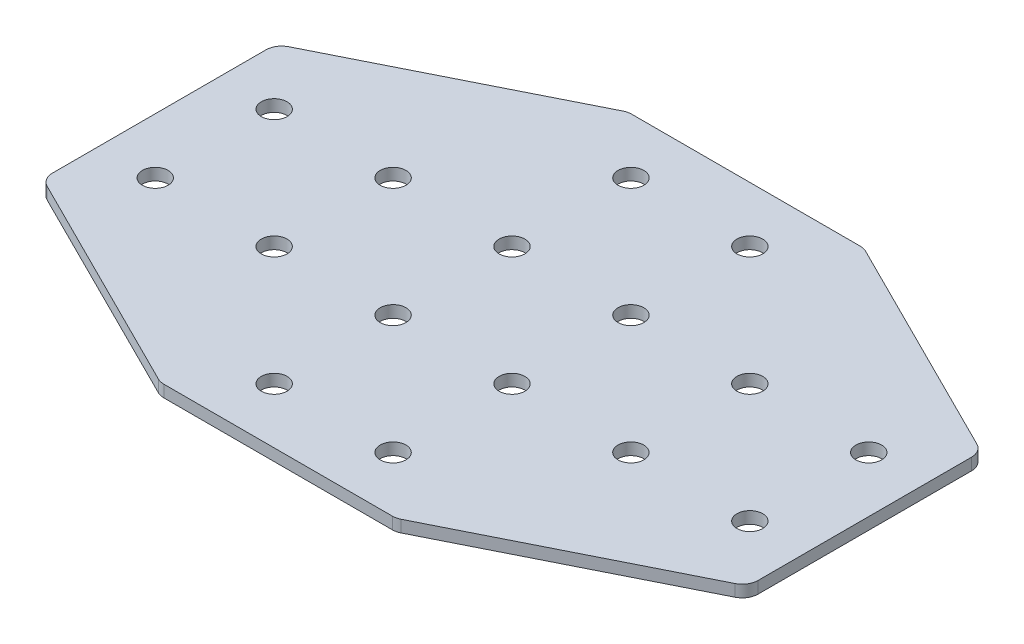
ISO-10303-21;
HEADER;
FILE_DESCRIPTION(('STEP AP214'),'2;1');
FILE_NAME('part.step','',(''),(''),'','','');
FILE_SCHEMA(('AUTOMOTIVE_DESIGN { 1 0 10303 214 1 1 1 1 }'));
ENDSEC;
DATA;
#1=APPLICATION_CONTEXT('core data for automotive mechanical design processes');
#2=APPLICATION_PROTOCOL_DEFINITION('international standard','automotive_design',2000,#1);
#3=PRODUCT_CONTEXT('',#1,'mechanical');
#4=PRODUCT('Part','Part','',(#3));
#5=PRODUCT_RELATED_PRODUCT_CATEGORY('part','',(#4));
#6=PRODUCT_DEFINITION_FORMATION('','',#4);
#7=PRODUCT_DEFINITION_CONTEXT('part definition',#1,'design');
#8=PRODUCT_DEFINITION('design','',#6,#7);
#9=PRODUCT_DEFINITION_SHAPE('','',#8);
#10=(LENGTH_UNIT() NAMED_UNIT(*) SI_UNIT(.MILLI.,.METRE.));
#11=(NAMED_UNIT(*) PLANE_ANGLE_UNIT() SI_UNIT($,.RADIAN.));
#12=(NAMED_UNIT(*) SI_UNIT($,.STERADIAN.) SOLID_ANGLE_UNIT());
#13=UNCERTAINTY_MEASURE_WITH_UNIT(LENGTH_MEASURE(1.E-05),#10,'distance_accuracy_value','');
#14=(GEOMETRIC_REPRESENTATION_CONTEXT(3) GLOBAL_UNCERTAINTY_ASSIGNED_CONTEXT((#13)) GLOBAL_UNIT_ASSIGNED_CONTEXT((#10,
#11,#12)) REPRESENTATION_CONTEXT('',''));
#15=CARTESIAN_POINT('',(0.,0.,0.));
#16=DIRECTION('',(0.,0.,1.));
#17=DIRECTION('',(1.,0.,0.));
#18=AXIS2_PLACEMENT_3D('',#15,#16,#17);
#19=CARTESIAN_POINT('',(-1.45351271942218,1.95798729377475,-1.25403448618044));
#20=DIRECTION('',(0.,-1.,0.));
#21=DIRECTION('',(0.,0.,-1.));
#22=AXIS2_PLACEMENT_3D('',#19,#20,#21);
#23=PLANE('',#22);
#24=CARTESIAN_POINT('',(-8.95351271942215,1.95798729377475,6.24596551381957));
#25=DIRECTION('',(0.,-1.,0.));
#26=DIRECTION('',(0.,0.,1.));
#27=AXIS2_PLACEMENT_3D('',#24,#25,#26);
#28=CIRCLE('',#27,1.625);
#29=CARTESIAN_POINT('',(-8.95351271942215,1.95798729377475,7.87096551381957));
#30=VERTEX_POINT('',#29);
#31=EDGE_CURVE('E140',#30,#30,#28,.T.);
#32=ORIENTED_EDGE('',*,*,#31,.F.);
#33=EDGE_LOOP('',(#32));
#34=FACE_BOUND('',#33,.T.);
#35=CARTESIAN_POINT('',(-8.95351271942218,1.95798729377475,21.2459655138196));
#36=DIRECTION('',(0.,-1.,0.));
#37=DIRECTION('',(0.,0.,1.));
#38=AXIS2_PLACEMENT_3D('',#35,#36,#37);
#39=CIRCLE('',#38,1.625);
#40=CARTESIAN_POINT('',(-8.95351271942218,1.95798729377475,22.8709655138196));
#41=VERTEX_POINT('',#40);
#42=EDGE_CURVE('E243',#41,#41,#39,.T.);
#43=ORIENTED_EDGE('',*,*,#42,.F.);
#44=EDGE_LOOP('',(#43));
#45=FACE_BOUND('',#44,.T.);
#46=CARTESIAN_POINT('',(-23.9535127194221,1.95798729377475,6.24596551381957));
#47=DIRECTION('',(0.,-1.,0.));
#48=DIRECTION('',(0.,0.,1.));
#49=AXIS2_PLACEMENT_3D('',#46,#47,#48);
#50=CIRCLE('',#49,1.625);
#51=CARTESIAN_POINT('',(-23.9535127194221,1.95798729377475,7.87096551381957));
#52=VERTEX_POINT('',#51);
#53=EDGE_CURVE('E237',#52,#52,#50,.T.);
#54=ORIENTED_EDGE('',*,*,#53,.F.);
#55=EDGE_LOOP('',(#54));
#56=FACE_BOUND('',#55,.T.);
#57=CARTESIAN_POINT('',(-38.9535127194222,1.95798729377475,6.24596551381956));
#58=DIRECTION('',(0.,-1.,0.));
#59=DIRECTION('',(0.,0.,1.));
#60=AXIS2_PLACEMENT_3D('',#57,#58,#59);
#61=CIRCLE('',#60,1.625);
#62=CARTESIAN_POINT('',(-38.9535127194222,1.95798729377475,7.87096551381956));
#63=VERTEX_POINT('',#62);
#64=EDGE_CURVE('E231',#63,#63,#61,.T.);
#65=ORIENTED_EDGE('',*,*,#64,.F.);
#66=EDGE_LOOP('',(#65));
#67=FACE_BOUND('',#66,.T.);
#68=CARTESIAN_POINT('',(6.04648728057779,1.95798729377475,6.24596551381956));
#69=DIRECTION('',(0.,1.,0.));
#70=DIRECTION('',(0.,0.,1.));
#71=AXIS2_PLACEMENT_3D('',#68,#69,#70);
#72=CIRCLE('',#71,1.625);
#73=CARTESIAN_POINT('',(6.04648728057779,1.95798729377475,7.87096551381957));
#74=VERTEX_POINT('',#73);
#75=EDGE_CURVE('E298',#74,#74,#72,.T.);
#76=ORIENTED_EDGE('',*,*,#75,.T.);
#77=EDGE_LOOP('',(#76));
#78=FACE_BOUND('',#77,.T.);
#79=CARTESIAN_POINT('',(6.04648728057782,1.95798729377475,21.2459655138196));
#80=DIRECTION('',(0.,1.,0.));
#81=DIRECTION('',(0.,0.,1.));
#82=AXIS2_PLACEMENT_3D('',#79,#80,#81);
#83=CIRCLE('',#82,1.625);
#84=CARTESIAN_POINT('',(6.04648728057782,1.95798729377475,22.8709655138196));
#85=VERTEX_POINT('',#84);
#86=EDGE_CURVE('E292',#85,#85,#83,.T.);
#87=ORIENTED_EDGE('',*,*,#86,.T.);
#88=EDGE_LOOP('',(#87));
#89=FACE_BOUND('',#88,.T.);
#90=CARTESIAN_POINT('',(21.0464872805778,1.95798729377475,6.24596551381957));
#91=DIRECTION('',(0.,1.,0.));
#92=DIRECTION('',(0.,0.,1.));
#93=AXIS2_PLACEMENT_3D('',#90,#91,#92);
#94=CIRCLE('',#93,1.625);
#95=CARTESIAN_POINT('',(21.0464872805778,1.95798729377475,7.87096551381957));
#96=VERTEX_POINT('',#95);
#97=EDGE_CURVE('E286',#96,#96,#94,.T.);
#98=ORIENTED_EDGE('',*,*,#97,.T.);
#99=EDGE_LOOP('',(#98));
#100=FACE_BOUND('',#99,.T.);
#101=CARTESIAN_POINT('',(36.0464872805778,1.95798729377475,6.24596551381955));
#102=DIRECTION('',(0.,1.,0.));
#103=DIRECTION('',(0.,0.,1.));
#104=AXIS2_PLACEMENT_3D('',#101,#102,#103);
#105=CIRCLE('',#104,1.625);
#106=CARTESIAN_POINT('',(36.0464872805778,1.95798729377475,7.87096551381955));
#107=VERTEX_POINT('',#106);
#108=EDGE_CURVE('E280',#107,#107,#105,.T.);
#109=ORIENTED_EDGE('',*,*,#108,.T.);
#110=EDGE_LOOP('',(#109));
#111=FACE_BOUND('',#110,.T.);
#112=DIRECTION('',(0.,0.,-1.));
#113=VECTOR('',#112,1.);
#114=CARTESIAN_POINT('',(-45.9535127194221,1.95798729377475,13.4369485194447));
#115=LINE('',#114,#113);
#116=CARTESIAN_POINT('',(-45.9535127194221,1.95798729377475,12.2008805419449));
#117=VERTEX_POINT('',#116);
#118=CARTESIAN_POINT('',(-45.9535127194221,1.95798729377475,-14.7089495143058));
#119=VERTEX_POINT('',#118);
#120=EDGE_CURVE('E253',#117,#119,#115,.T.);
#121=ORIENTED_EDGE('',*,*,#120,.T.);
#122=CARTESIAN_POINT('',(-43.9535127194221,1.95798729377475,-14.7089495143058));
#123=DIRECTION('',(0.,-1.,0.));
#124=DIRECTION('',(0.,0.,1.));
#125=AXIS2_PLACEMENT_3D('',#122,#123,#124);
#126=CIRCLE('',#125,2.);
#127=CARTESIAN_POINT('',(-44.847939910422,1.95798729377475,-16.4978038963056));
#128=VERTEX_POINT('',#127);
#129=EDGE_CURVE('E148',#119,#128,#126,.T.);
#130=ORIENTED_EDGE('',*,*,#129,.T.);
#131=DIRECTION('',(-0.894427190999916,0.,0.447213595499958));
#132=VECTOR('',#131,1.);
#133=CARTESIAN_POINT('',(-16.3354787306724,1.95798729377475,-30.7540344861804));
#134=LINE('',#133,#132);
#135=CARTESIAN_POINT('',(-16.7577699666727,1.95798729377475,-30.5428888681802));
#136=VERTEX_POINT('',#135);
#137=EDGE_CURVE('E158',#136,#128,#134,.T.);
#138=ORIENTED_EDGE('',*,*,#137,.F.);
#139=CARTESIAN_POINT('',(-15.8633427756728,1.95798729377475,-28.7540344861804));
#140=DIRECTION('',(0.,-1.,0.));
#141=DIRECTION('',(0.,0.,1.));
#142=AXIS2_PLACEMENT_3D('',#139,#140,#141);
#143=CIRCLE('',#142,2.);
#144=CARTESIAN_POINT('',(-15.8633427756728,1.95798729377475,-30.7540344861804));
#145=VERTEX_POINT('',#144);
#146=EDGE_CURVE('E168',#136,#145,#143,.T.);
#147=ORIENTED_EDGE('',*,*,#146,.T.);
#148=DIRECTION('',(1.,0.,0.));
#149=VECTOR('',#148,1.);
#150=CARTESIAN_POINT('',(-15.9535127194223,1.95798729377475,-30.7540344861804));
#151=LINE('',#150,#149);
#152=CARTESIAN_POINT('',(12.9563173368285,1.95798729377475,-30.7540344861804));
#153=VERTEX_POINT('',#152);
#154=EDGE_CURVE('E198',#145,#153,#151,.T.);
#155=ORIENTED_EDGE('',*,*,#154,.T.);
#156=CARTESIAN_POINT('',(12.9563173368285,1.95798729377475,-28.7540344861804));
#157=DIRECTION('',(0.,1.,0.));
#158=DIRECTION('',(0.,0.,1.));
#159=AXIS2_PLACEMENT_3D('',#156,#157,#158);
#160=CIRCLE('',#159,2.);
#161=CARTESIAN_POINT('',(13.8507445278284,1.95798729377475,-30.5428888681802));
#162=VERTEX_POINT('',#161);
#163=EDGE_CURVE('E220',#162,#153,#160,.T.);
#164=ORIENTED_EDGE('',*,*,#163,.F.);
#165=DIRECTION('',(0.894427190999916,0.,0.447213595499959));
#166=VECTOR('',#165,1.);
#167=CARTESIAN_POINT('',(13.428453291828,1.95798729377475,-30.7540344861804));
#168=LINE('',#167,#166);
#169=CARTESIAN_POINT('',(41.9409144715776,1.95798729377475,-16.4978038963056));
#170=VERTEX_POINT('',#169);
#171=EDGE_CURVE('E201',#162,#170,#168,.T.);
#172=ORIENTED_EDGE('',*,*,#171,.T.);
#173=CARTESIAN_POINT('',(41.0464872805777,1.95798729377475,-14.7089495143057));
#174=DIRECTION('',(0.,1.,0.));
#175=DIRECTION('',(0.,0.,1.));
#176=AXIS2_PLACEMENT_3D('',#173,#174,#175);
#177=CIRCLE('',#176,2.);
#178=CARTESIAN_POINT('',(43.0464872805777,1.95798729377475,-14.7089495143057));
#179=VERTEX_POINT('',#178);
#180=EDGE_CURVE('E217',#179,#170,#177,.T.);
#181=ORIENTED_EDGE('',*,*,#180,.F.);
#182=DIRECTION('',(0.,0.,-1.));
#183=VECTOR('',#182,1.);
#184=CARTESIAN_POINT('',(43.0464872805777,1.95798729377475,13.4369485194446));
#185=LINE('',#184,#183);
#186=CARTESIAN_POINT('',(43.0464872805777,1.95798729377475,12.2008805419449));
#187=VERTEX_POINT('',#186);
#188=EDGE_CURVE('E304',#187,#179,#185,.T.);
#189=ORIENTED_EDGE('',*,*,#188,.F.);
#190=CARTESIAN_POINT('',(41.0464872805777,1.95798729377475,12.2008805419449));
#191=DIRECTION('',(0.,-1.,0.));
#192=DIRECTION('',(0.,0.,-1.));
#193=AXIS2_PLACEMENT_3D('',#190,#191,#192);
#194=CIRCLE('',#193,2.);
#195=CARTESIAN_POINT('',(41.9409144715776,1.95798729377475,13.9897349239447));
#196=VERTEX_POINT('',#195);
#197=EDGE_CURVE('E31',#187,#196,#194,.T.);
#198=ORIENTED_EDGE('',*,*,#197,.T.);
#199=DIRECTION('',(0.894427190999916,0.,-0.447213595499959));
#200=VECTOR('',#199,1.);
#201=CARTESIAN_POINT('',(13.428453291828,1.95798729377475,28.2459655138195));
#202=LINE('',#201,#200);
#203=CARTESIAN_POINT('',(13.8507445278284,1.95798729377475,28.0348198958193));
#204=VERTEX_POINT('',#203);
#205=EDGE_CURVE('E309',#204,#196,#202,.T.);
#206=ORIENTED_EDGE('',*,*,#205,.F.);
#207=CARTESIAN_POINT('',(12.9563173368285,1.95798729377475,26.2459655138195));
#208=DIRECTION('',(0.,-1.,0.));
#209=DIRECTION('',(0.,0.,-1.));
#210=AXIS2_PLACEMENT_3D('',#207,#208,#209);
#211=CIRCLE('',#210,2.);
#212=CARTESIAN_POINT('',(12.9563173368285,1.95798729377475,28.2459655138195));
#213=VERTEX_POINT('',#212);
#214=EDGE_CURVE('E324',#204,#213,#211,.T.);
#215=ORIENTED_EDGE('',*,*,#214,.T.);
#216=DIRECTION('',(1.,0.,0.));
#217=VECTOR('',#216,1.);
#218=CARTESIAN_POINT('',(-15.9535127194223,1.95798729377475,28.2459655138195));
#219=LINE('',#218,#217);
#220=CARTESIAN_POINT('',(-15.8633427756728,1.95798729377475,28.2459655138195));
#221=VERTEX_POINT('',#220);
#222=EDGE_CURVE('E306',#221,#213,#219,.T.);
#223=ORIENTED_EDGE('',*,*,#222,.F.);
#224=CARTESIAN_POINT('',(-15.8633427756728,1.95798729377475,26.2459655138195));
#225=DIRECTION('',(0.,1.,0.));
#226=DIRECTION('',(0.,0.,-1.));
#227=AXIS2_PLACEMENT_3D('',#224,#225,#226);
#228=CIRCLE('',#227,2.);
#229=CARTESIAN_POINT('',(-16.7577699666727,1.95798729377475,28.0348198958193));
#230=VERTEX_POINT('',#229);
#231=EDGE_CURVE('E270',#230,#221,#228,.T.);
#232=ORIENTED_EDGE('',*,*,#231,.F.);
#233=DIRECTION('',(-0.894427190999916,0.,-0.447213595499958));
#234=VECTOR('',#233,1.);
#235=CARTESIAN_POINT('',(-16.3354787306724,1.95798729377475,28.2459655138195));
#236=LINE('',#235,#234);
#237=CARTESIAN_POINT('',(-44.847939910422,1.95798729377475,13.9897349239447));
#238=VERTEX_POINT('',#237);
#239=EDGE_CURVE('E255',#230,#238,#236,.T.);
#240=ORIENTED_EDGE('',*,*,#239,.T.);
#241=CARTESIAN_POINT('',(-43.9535127194221,1.95798729377475,12.2008805419449));
#242=DIRECTION('',(0.,1.,0.));
#243=DIRECTION('',(0.,0.,-1.));
#244=AXIS2_PLACEMENT_3D('',#241,#242,#243);
#245=CIRCLE('',#244,2.);
#246=EDGE_CURVE('E267',#117,#238,#245,.T.);
#247=ORIENTED_EDGE('',*,*,#246,.F.);
#248=EDGE_LOOP('',(#121,#130,#138,#147,#155,#164,#172,#181,#189,#198,#206,#215,#223,#232,#240,#247));
#249=FACE_BOUND('',#248,.T.);
#250=CARTESIAN_POINT('',(-8.95351271942215,1.95798729377475,-8.75403448618045));
#251=DIRECTION('',(0.,1.,0.));
#252=DIRECTION('',(0.,0.,-1.));
#253=AXIS2_PLACEMENT_3D('',#250,#251,#252);
#254=CIRCLE('',#253,1.625);
#255=CARTESIAN_POINT('',(-8.95351271942215,1.95798729377475,-10.3790344861805));
#256=VERTEX_POINT('',#255);
#257=EDGE_CURVE('E352',#256,#256,#254,.T.);
#258=ORIENTED_EDGE('',*,*,#257,.T.);
#259=EDGE_LOOP('',(#258));
#260=FACE_BOUND('',#259,.T.);
#261=CARTESIAN_POINT('',(-8.95351271942218,1.95798729377475,-23.7540344861804));
#262=DIRECTION('',(0.,1.,0.));
#263=DIRECTION('',(0.,0.,-1.));
#264=AXIS2_PLACEMENT_3D('',#261,#262,#263);
#265=CIRCLE('',#264,1.625);
#266=CARTESIAN_POINT('',(-8.95351271942218,1.95798729377475,-25.3790344861804));
#267=VERTEX_POINT('',#266);
#268=EDGE_CURVE('E356',#267,#267,#265,.T.);
#269=ORIENTED_EDGE('',*,*,#268,.T.);
#270=EDGE_LOOP('',(#269));
#271=FACE_BOUND('',#270,.T.);
#272=CARTESIAN_POINT('',(-23.9535127194221,1.95798729377475,-8.75403448618046));
#273=DIRECTION('',(0.,1.,0.));
#274=DIRECTION('',(0.,0.,-1.));
#275=AXIS2_PLACEMENT_3D('',#272,#273,#274);
#276=CIRCLE('',#275,1.625);
#277=CARTESIAN_POINT('',(-23.9535127194221,1.95798729377475,-10.3790344861805));
#278=VERTEX_POINT('',#277);
#279=EDGE_CURVE('E360',#278,#278,#276,.T.);
#280=ORIENTED_EDGE('',*,*,#279,.T.);
#281=EDGE_LOOP('',(#280));
#282=FACE_BOUND('',#281,.T.);
#283=CARTESIAN_POINT('',(-38.9535127194222,1.95798729377475,-8.75403448618045));
#284=DIRECTION('',(0.,1.,0.));
#285=DIRECTION('',(0.,0.,-1.));
#286=AXIS2_PLACEMENT_3D('',#283,#284,#285);
#287=CIRCLE('',#286,1.625);
#288=CARTESIAN_POINT('',(-38.9535127194222,1.95798729377475,-10.3790344861805));
#289=VERTEX_POINT('',#288);
#290=EDGE_CURVE('E364',#289,#289,#287,.T.);
#291=ORIENTED_EDGE('',*,*,#290,.T.);
#292=EDGE_LOOP('',(#291));
#293=FACE_BOUND('',#292,.T.);
#294=CARTESIAN_POINT('',(6.04648728057779,1.95798729377475,-8.75403448618045));
#295=DIRECTION('',(0.,-1.,0.));
#296=DIRECTION('',(0.,0.,-1.));
#297=AXIS2_PLACEMENT_3D('',#294,#295,#296);
#298=CIRCLE('',#297,1.625);
#299=CARTESIAN_POINT('',(6.04648728057779,1.95798729377475,-10.3790344861805));
#300=VERTEX_POINT('',#299);
#301=EDGE_CURVE('E192',#300,#300,#298,.T.);
#302=ORIENTED_EDGE('',*,*,#301,.F.);
#303=EDGE_LOOP('',(#302));
#304=FACE_BOUND('',#303,.T.);
#305=CARTESIAN_POINT('',(6.04648728057782,1.95798729377475,-23.7540344861804));
#306=DIRECTION('',(0.,-1.,0.));
#307=DIRECTION('',(0.,0.,-1.));
#308=AXIS2_PLACEMENT_3D('',#305,#306,#307);
#309=CIRCLE('',#308,1.625);
#310=CARTESIAN_POINT('',(6.04648728057782,1.95798729377475,-25.3790344861804));
#311=VERTEX_POINT('',#310);
#312=EDGE_CURVE('E186',#311,#311,#309,.T.);
#313=ORIENTED_EDGE('',*,*,#312,.F.);
#314=EDGE_LOOP('',(#313));
#315=FACE_BOUND('',#314,.T.);
#316=CARTESIAN_POINT('',(21.0464872805778,1.95798729377475,-8.75403448618045));
#317=DIRECTION('',(0.,-1.,0.));
#318=DIRECTION('',(0.,0.,-1.));
#319=AXIS2_PLACEMENT_3D('',#316,#317,#318);
#320=CIRCLE('',#319,1.625);
#321=CARTESIAN_POINT('',(21.0464872805778,1.95798729377475,-10.3790344861805));
#322=VERTEX_POINT('',#321);
#323=EDGE_CURVE('E180',#322,#322,#320,.T.);
#324=ORIENTED_EDGE('',*,*,#323,.F.);
#325=EDGE_LOOP('',(#324));
#326=FACE_BOUND('',#325,.T.);
#327=CARTESIAN_POINT('',(36.0464872805778,1.95798729377475,-8.75403448618044));
#328=DIRECTION('',(0.,-1.,0.));
#329=DIRECTION('',(0.,0.,-1.));
#330=AXIS2_PLACEMENT_3D('',#327,#328,#329);
#331=CIRCLE('',#330,1.625);
#332=CARTESIAN_POINT('',(36.0464872805778,1.95798729377475,-10.3790344861804));
#333=VERTEX_POINT('',#332);
#334=EDGE_CURVE('E174',#333,#333,#331,.T.);
#335=ORIENTED_EDGE('',*,*,#334,.F.);
#336=EDGE_LOOP('',(#335));
#337=FACE_BOUND('',#336,.T.);
#338=ADVANCED_FACE('F16',(#34,#45,#56,#67,#78,#89,#100,#111,#249,#260,#271,#282,#293,#304,#315,
#326,#337),#23,.T.);
#339=CARTESIAN_POINT('',(43.0464872805777,1.95798729377475,13.4369485194446));
#340=DIRECTION('',(1.,0.,0.));
#341=DIRECTION('',(0.,0.,-1.));
#342=AXIS2_PLACEMENT_3D('',#339,#340,#341);
#343=PLANE('',#342);
#344=ORIENTED_EDGE('',*,*,#188,.T.);
#345=DIRECTION('',(0.,1.,0.));
#346=VECTOR('',#345,1.);
#347=CARTESIAN_POINT('',(43.0464872805777,1.95798729377475,-14.7089495143057));
#348=LINE('',#347,#346);
#349=CARTESIAN_POINT('',(43.0464872805777,3.45798729377475,-14.7089495143057));
#350=VERTEX_POINT('',#349);
#351=EDGE_CURVE('E227',#350,#179,#348,.F.);
#352=ORIENTED_EDGE('',*,*,#351,.F.);
#353=DIRECTION('',(0.,0.,-1.));
#354=VECTOR('',#353,1.);
#355=CARTESIAN_POINT('',(43.0464872805777,3.45798729377475,13.4369485194446));
#356=LINE('',#355,#354);
#357=CARTESIAN_POINT('',(43.0464872805777,3.45798729377475,12.2008805419449));
#358=VERTEX_POINT('',#357);
#359=EDGE_CURVE('E301',#358,#350,#356,.T.);
#360=ORIENTED_EDGE('',*,*,#359,.F.);
#361=DIRECTION('',(0.,1.,0.));
#362=VECTOR('',#361,1.);
#363=CARTESIAN_POINT('',(43.0464872805777,1.95798729377475,12.2008805419449));
#364=LINE('',#363,#362);
#365=EDGE_CURVE('E10',#358,#187,#364,.F.);
#366=ORIENTED_EDGE('',*,*,#365,.T.);
#367=EDGE_LOOP('',(#344,#352,#360,#366));
#368=FACE_BOUND('',#367,.T.);
#369=ADVANCED_FACE('F346',(#368),#343,.T.);
#370=CARTESIAN_POINT('',(-1.45351271942218,3.45798729377475,-1.25403448618044));
#371=DIRECTION('',(0.,-1.,0.));
#372=DIRECTION('',(0.,0.,-1.));
#373=AXIS2_PLACEMENT_3D('',#370,#371,#372);
#374=PLANE('',#373);
#375=CARTESIAN_POINT('',(-8.95351271942215,3.45798729377475,6.24596551381957));
#376=DIRECTION('',(0.,-1.,0.));
#377=DIRECTION('',(0.,0.,1.));
#378=AXIS2_PLACEMENT_3D('',#375,#376,#377);
#379=CIRCLE('',#378,1.625);
#380=CARTESIAN_POINT('',(-8.95351271942215,3.45798729377475,7.87096551381957));
#381=VERTEX_POINT('',#380);
#382=EDGE_CURVE('E246',#381,#381,#379,.T.);
#383=ORIENTED_EDGE('',*,*,#382,.T.);
#384=EDGE_LOOP('',(#383));
#385=FACE_BOUND('',#384,.T.);
#386=CARTESIAN_POINT('',(-8.95351271942218,3.45798729377475,21.2459655138196));
#387=DIRECTION('',(0.,-1.,0.));
#388=DIRECTION('',(0.,0.,1.));
#389=AXIS2_PLACEMENT_3D('',#386,#387,#388);
#390=CIRCLE('',#389,1.625);
#391=CARTESIAN_POINT('',(-8.95351271942218,3.45798729377475,22.8709655138196));
#392=VERTEX_POINT('',#391);
#393=EDGE_CURVE('E240',#392,#392,#390,.T.);
#394=ORIENTED_EDGE('',*,*,#393,.T.);
#395=EDGE_LOOP('',(#394));
#396=FACE_BOUND('',#395,.T.);
#397=CARTESIAN_POINT('',(-23.9535127194221,3.45798729377475,6.24596551381957));
#398=DIRECTION('',(0.,-1.,0.));
#399=DIRECTION('',(0.,0.,1.));
#400=AXIS2_PLACEMENT_3D('',#397,#398,#399);
#401=CIRCLE('',#400,1.625);
#402=CARTESIAN_POINT('',(-23.9535127194221,3.45798729377475,7.87096551381957));
#403=VERTEX_POINT('',#402);
#404=EDGE_CURVE('E234',#403,#403,#401,.T.);
#405=ORIENTED_EDGE('',*,*,#404,.T.);
#406=EDGE_LOOP('',(#405));
#407=FACE_BOUND('',#406,.T.);
#408=CARTESIAN_POINT('',(-38.9535127194222,3.45798729377475,6.24596551381956));
#409=DIRECTION('',(0.,-1.,0.));
#410=DIRECTION('',(0.,0.,1.));
#411=AXIS2_PLACEMENT_3D('',#408,#409,#410);
#412=CIRCLE('',#411,1.625);
#413=CARTESIAN_POINT('',(-38.9535127194222,3.45798729377475,7.87096551381956));
#414=VERTEX_POINT('',#413);
#415=EDGE_CURVE('E230',#414,#414,#412,.T.);
#416=ORIENTED_EDGE('',*,*,#415,.T.);
#417=EDGE_LOOP('',(#416));
#418=FACE_BOUND('',#417,.T.);
#419=CARTESIAN_POINT('',(6.04648728057779,3.45798729377475,6.24596551381956));
#420=DIRECTION('',(0.,1.,0.));
#421=DIRECTION('',(0.,0.,1.));
#422=AXIS2_PLACEMENT_3D('',#419,#420,#421);
#423=CIRCLE('',#422,1.625);
#424=CARTESIAN_POINT('',(6.04648728057779,3.45798729377475,7.87096551381957));
#425=VERTEX_POINT('',#424);
#426=EDGE_CURVE('E295',#425,#425,#423,.T.);
#427=ORIENTED_EDGE('',*,*,#426,.F.);
#428=EDGE_LOOP('',(#427));
#429=FACE_BOUND('',#428,.T.);
#430=CARTESIAN_POINT('',(6.04648728057782,3.45798729377475,21.2459655138196));
#431=DIRECTION('',(0.,1.,0.));
#432=DIRECTION('',(0.,0.,1.));
#433=AXIS2_PLACEMENT_3D('',#430,#431,#432);
#434=CIRCLE('',#433,1.625);
#435=CARTESIAN_POINT('',(6.04648728057782,3.45798729377475,22.8709655138196));
#436=VERTEX_POINT('',#435);
#437=EDGE_CURVE('E289',#436,#436,#434,.T.);
#438=ORIENTED_EDGE('',*,*,#437,.F.);
#439=EDGE_LOOP('',(#438));
#440=FACE_BOUND('',#439,.T.);
#441=CARTESIAN_POINT('',(21.0464872805778,3.45798729377475,6.24596551381957));
#442=DIRECTION('',(0.,1.,0.));
#443=DIRECTION('',(0.,0.,1.));
#444=AXIS2_PLACEMENT_3D('',#441,#442,#443);
#445=CIRCLE('',#444,1.625);
#446=CARTESIAN_POINT('',(21.0464872805778,3.45798729377475,7.87096551381957));
#447=VERTEX_POINT('',#446);
#448=EDGE_CURVE('E283',#447,#447,#445,.T.);
#449=ORIENTED_EDGE('',*,*,#448,.F.);
#450=EDGE_LOOP('',(#449));
#451=FACE_BOUND('',#450,.T.);
#452=CARTESIAN_POINT('',(36.0464872805778,3.45798729377475,6.24596551381955));
#453=DIRECTION('',(0.,1.,0.));
#454=DIRECTION('',(0.,0.,1.));
#455=AXIS2_PLACEMENT_3D('',#452,#453,#454);
#456=CIRCLE('',#455,1.625);
#457=CARTESIAN_POINT('',(36.0464872805778,3.45798729377475,7.87096551381955));
#458=VERTEX_POINT('',#457);
#459=EDGE_CURVE('E279',#458,#458,#456,.T.);
#460=ORIENTED_EDGE('',*,*,#459,.F.);
#461=EDGE_LOOP('',(#460));
#462=FACE_BOUND('',#461,.T.);
#463=ORIENTED_EDGE('',*,*,#359,.T.);
#464=CARTESIAN_POINT('',(41.0464872805777,3.45798729377475,-14.7089495143057));
#465=DIRECTION('',(0.,1.,0.));
#466=DIRECTION('',(0.,0.,1.));
#467=AXIS2_PLACEMENT_3D('',#464,#465,#466);
#468=CIRCLE('',#467,2.);
#469=CARTESIAN_POINT('',(41.9409144715776,3.45798729377475,-16.4978038963056));
#470=VERTEX_POINT('',#469);
#471=EDGE_CURVE('E205',#470,#350,#468,.F.);
#472=ORIENTED_EDGE('',*,*,#471,.F.);
#473=DIRECTION('',(0.894427190999916,0.,0.447213595499959));
#474=VECTOR('',#473,1.);
#475=CARTESIAN_POINT('',(13.428453291828,3.45798729377475,-30.7540344861804));
#476=LINE('',#475,#474);
#477=CARTESIAN_POINT('',(13.8507445278284,3.45798729377475,-30.5428888681802));
#478=VERTEX_POINT('',#477);
#479=EDGE_CURVE('E202',#478,#470,#476,.T.);
#480=ORIENTED_EDGE('',*,*,#479,.F.);
#481=CARTESIAN_POINT('',(12.9563173368285,3.45798729377475,-28.7540344861804));
#482=DIRECTION('',(0.,1.,0.));
#483=DIRECTION('',(0.,0.,1.));
#484=AXIS2_PLACEMENT_3D('',#481,#482,#483);
#485=CIRCLE('',#484,2.);
#486=CARTESIAN_POINT('',(12.9563173368285,3.45798729377475,-30.7540344861804));
#487=VERTEX_POINT('',#486);
#488=EDGE_CURVE('E212',#487,#478,#485,.F.);
#489=ORIENTED_EDGE('',*,*,#488,.F.);
#490=DIRECTION('',(1.,0.,0.));
#491=VECTOR('',#490,1.);
#492=CARTESIAN_POINT('',(-15.9535127194223,3.45798729377475,-30.7540344861804));
#493=LINE('',#492,#491);
#494=CARTESIAN_POINT('',(-15.8633427756728,3.45798729377475,-30.7540344861804));
#495=VERTEX_POINT('',#494);
#496=EDGE_CURVE('E195',#495,#487,#493,.T.);
#497=ORIENTED_EDGE('',*,*,#496,.F.);
#498=CARTESIAN_POINT('',(-15.8633427756728,3.45798729377475,-28.7540344861804));
#499=DIRECTION('',(0.,-1.,0.));
#500=DIRECTION('',(0.,0.,1.));
#501=AXIS2_PLACEMENT_3D('',#498,#499,#500);
#502=CIRCLE('',#501,2.);
#503=CARTESIAN_POINT('',(-16.7577699666727,3.45798729377475,-30.5428888681802));
#504=VERTEX_POINT('',#503);
#505=EDGE_CURVE('E157',#495,#504,#502,.F.);
#506=ORIENTED_EDGE('',*,*,#505,.T.);
#507=DIRECTION('',(-0.894427190999916,0.,0.447213595499958));
#508=VECTOR('',#507,1.);
#509=CARTESIAN_POINT('',(-16.3354787306724,3.45798729377475,-30.7540344861804));
#510=LINE('',#509,#508);
#511=CARTESIAN_POINT('',(-44.847939910422,3.45798729377475,-16.4978038963056));
#512=VERTEX_POINT('',#511);
#513=EDGE_CURVE('E156',#504,#512,#510,.T.);
#514=ORIENTED_EDGE('',*,*,#513,.T.);
#515=CARTESIAN_POINT('',(-43.9535127194221,3.45798729377475,-14.7089495143058));
#516=DIRECTION('',(0.,-1.,0.));
#517=DIRECTION('',(0.,0.,1.));
#518=AXIS2_PLACEMENT_3D('',#515,#516,#517);
#519=CIRCLE('',#518,2.);
#520=CARTESIAN_POINT('',(-45.9535127194221,3.45798729377475,-14.7089495143058));
#521=VERTEX_POINT('',#520);
#522=EDGE_CURVE('E145',#512,#521,#519,.F.);
#523=ORIENTED_EDGE('',*,*,#522,.T.);
#524=DIRECTION('',(0.,0.,-1.));
#525=VECTOR('',#524,1.);
#526=CARTESIAN_POINT('',(-45.9535127194221,3.45798729377475,13.4369485194447));
#527=LINE('',#526,#525);
#528=CARTESIAN_POINT('',(-45.9535127194221,3.45798729377475,12.2008805419449));
#529=VERTEX_POINT('',#528);
#530=EDGE_CURVE('E130',#529,#521,#527,.T.);
#531=ORIENTED_EDGE('',*,*,#530,.F.);
#532=CARTESIAN_POINT('',(-43.9535127194221,3.45798729377475,12.2008805419449));
#533=DIRECTION('',(0.,1.,0.));
#534=DIRECTION('',(0.,0.,-1.));
#535=AXIS2_PLACEMENT_3D('',#532,#533,#534);
#536=CIRCLE('',#535,2.);
#537=CARTESIAN_POINT('',(-44.847939910422,3.45798729377475,13.9897349239447));
#538=VERTEX_POINT('',#537);
#539=EDGE_CURVE('E257',#538,#529,#536,.F.);
#540=ORIENTED_EDGE('',*,*,#539,.F.);
#541=DIRECTION('',(-0.894427190999916,0.,-0.447213595499958));
#542=VECTOR('',#541,1.);
#543=CARTESIAN_POINT('',(-16.3354787306724,3.45798729377475,28.2459655138195));
#544=LINE('',#543,#542);
#545=CARTESIAN_POINT('',(-16.7577699666727,3.45798729377475,28.0348198958193));
#546=VERTEX_POINT('',#545);
#547=EDGE_CURVE('E139',#546,#538,#544,.T.);
#548=ORIENTED_EDGE('',*,*,#547,.F.);
#549=CARTESIAN_POINT('',(-15.8633427756728,3.45798729377475,26.2459655138195));
#550=DIRECTION('',(0.,1.,0.));
#551=DIRECTION('',(0.,0.,-1.));
#552=AXIS2_PLACEMENT_3D('',#549,#550,#551);
#553=CIRCLE('',#552,2.);
#554=CARTESIAN_POINT('',(-15.8633427756728,3.45798729377475,28.2459655138195));
#555=VERTEX_POINT('',#554);
#556=EDGE_CURVE('E262',#555,#546,#553,.F.);
#557=ORIENTED_EDGE('',*,*,#556,.F.);
#558=DIRECTION('',(1.,0.,0.));
#559=VECTOR('',#558,1.);
#560=CARTESIAN_POINT('',(-15.9535127194223,3.45798729377475,28.2459655138195));
#561=LINE('',#560,#559);
#562=CARTESIAN_POINT('',(12.9563173368285,3.45798729377475,28.2459655138195));
#563=VERTEX_POINT('',#562);
#564=EDGE_CURVE('E313',#555,#563,#561,.T.);
#565=ORIENTED_EDGE('',*,*,#564,.T.);
#566=CARTESIAN_POINT('',(12.9563173368285,3.45798729377475,26.2459655138195));
#567=DIRECTION('',(0.,-1.,0.));
#568=DIRECTION('',(0.,0.,-1.));
#569=AXIS2_PLACEMENT_3D('',#566,#567,#568);
#570=CIRCLE('',#569,2.);
#571=CARTESIAN_POINT('',(13.8507445278284,3.45798729377475,28.0348198958193));
#572=VERTEX_POINT('',#571);
#573=EDGE_CURVE('E318',#563,#572,#570,.F.);
#574=ORIENTED_EDGE('',*,*,#573,.T.);
#575=DIRECTION('',(0.894427190999916,0.,-0.447213595499959));
#576=VECTOR('',#575,1.);
#577=CARTESIAN_POINT('',(13.428453291828,3.45798729377475,28.2459655138195));
#578=LINE('',#577,#576);
#579=CARTESIAN_POINT('',(41.9409144715776,3.45798729377475,13.9897349239447));
#580=VERTEX_POINT('',#579);
#581=EDGE_CURVE('E307',#572,#580,#578,.T.);
#582=ORIENTED_EDGE('',*,*,#581,.T.);
#583=CARTESIAN_POINT('',(41.0464872805777,3.45798729377475,12.2008805419449));
#584=DIRECTION('',(0.,-1.,0.));
#585=DIRECTION('',(0.,0.,-1.));
#586=AXIS2_PLACEMENT_3D('',#583,#584,#585);
#587=CIRCLE('',#586,2.);
#588=EDGE_CURVE('E311',#580,#358,#587,.F.);
#589=ORIENTED_EDGE('',*,*,#588,.T.);
#590=EDGE_LOOP('',(#463,#472,#480,#489,#497,#506,#514,#523,#531,#540,#548,#557,#565,#574,#582,#589));
#591=FACE_BOUND('',#590,.T.);
#592=CARTESIAN_POINT('',(-8.95351271942215,3.45798729377475,-8.75403448618045));
#593=DIRECTION('',(0.,1.,0.));
#594=DIRECTION('',(0.,0.,-1.));
#595=AXIS2_PLACEMENT_3D('',#592,#593,#594);
#596=CIRCLE('',#595,1.625);
#597=CARTESIAN_POINT('',(-8.95351271942215,3.45798729377475,-10.3790344861805));
#598=VERTEX_POINT('',#597);
#599=EDGE_CURVE('E515',#598,#598,#596,.T.);
#600=ORIENTED_EDGE('',*,*,#599,.F.);
#601=EDGE_LOOP('',(#600));
#602=FACE_BOUND('',#601,.T.);
#603=CARTESIAN_POINT('',(-8.95351271942218,3.45798729377475,-23.7540344861804));
#604=DIRECTION('',(0.,1.,0.));
#605=DIRECTION('',(0.,0.,-1.));
#606=AXIS2_PLACEMENT_3D('',#603,#604,#605);
#607=CIRCLE('',#606,1.625);
#608=CARTESIAN_POINT('',(-8.95351271942218,3.45798729377475,-25.3790344861804));
#609=VERTEX_POINT('',#608);
#610=EDGE_CURVE('E511',#609,#609,#607,.T.);
#611=ORIENTED_EDGE('',*,*,#610,.F.);
#612=EDGE_LOOP('',(#611));
#613=FACE_BOUND('',#612,.T.);
#614=CARTESIAN_POINT('',(-23.9535127194221,3.45798729377475,-8.75403448618046));
#615=DIRECTION('',(0.,1.,0.));
#616=DIRECTION('',(0.,0.,-1.));
#617=AXIS2_PLACEMENT_3D('',#614,#615,#616);
#618=CIRCLE('',#617,1.625);
#619=CARTESIAN_POINT('',(-23.9535127194221,3.45798729377475,-10.3790344861805));
#620=VERTEX_POINT('',#619);
#621=EDGE_CURVE('E507',#620,#620,#618,.T.);
#622=ORIENTED_EDGE('',*,*,#621,.F.);
#623=EDGE_LOOP('',(#622));
#624=FACE_BOUND('',#623,.T.);
#625=CARTESIAN_POINT('',(-38.9535127194222,3.45798729377475,-8.75403448618045));
#626=DIRECTION('',(0.,1.,0.));
#627=DIRECTION('',(0.,0.,-1.));
#628=AXIS2_PLACEMENT_3D('',#625,#626,#627);
#629=CIRCLE('',#628,1.625);
#630=CARTESIAN_POINT('',(-38.9535127194222,3.45798729377475,-10.3790344861805));
#631=VERTEX_POINT('',#630);
#632=EDGE_CURVE('E504',#631,#631,#629,.T.);
#633=ORIENTED_EDGE('',*,*,#632,.F.);
#634=EDGE_LOOP('',(#633));
#635=FACE_BOUND('',#634,.T.);
#636=CARTESIAN_POINT('',(6.04648728057779,3.45798729377475,-8.75403448618045));
#637=DIRECTION('',(0.,-1.,0.));
#638=DIRECTION('',(0.,0.,-1.));
#639=AXIS2_PLACEMENT_3D('',#636,#637,#638);
#640=CIRCLE('',#639,1.625);
#641=CARTESIAN_POINT('',(6.04648728057779,3.45798729377475,-10.3790344861805));
#642=VERTEX_POINT('',#641);
#643=EDGE_CURVE('E189',#642,#642,#640,.T.);
#644=ORIENTED_EDGE('',*,*,#643,.T.);
#645=EDGE_LOOP('',(#644));
#646=FACE_BOUND('',#645,.T.);
#647=CARTESIAN_POINT('',(6.04648728057782,3.45798729377475,-23.7540344861804));
#648=DIRECTION('',(0.,-1.,0.));
#649=DIRECTION('',(0.,0.,-1.));
#650=AXIS2_PLACEMENT_3D('',#647,#648,#649);
#651=CIRCLE('',#650,1.625);
#652=CARTESIAN_POINT('',(6.04648728057782,3.45798729377475,-25.3790344861804));
#653=VERTEX_POINT('',#652);
#654=EDGE_CURVE('E183',#653,#653,#651,.T.);
#655=ORIENTED_EDGE('',*,*,#654,.T.);
#656=EDGE_LOOP('',(#655));
#657=FACE_BOUND('',#656,.T.);
#658=CARTESIAN_POINT('',(21.0464872805778,3.45798729377475,-8.75403448618045));
#659=DIRECTION('',(0.,-1.,0.));
#660=DIRECTION('',(0.,0.,-1.));
#661=AXIS2_PLACEMENT_3D('',#658,#659,#660);
#662=CIRCLE('',#661,1.625);
#663=CARTESIAN_POINT('',(21.0464872805778,3.45798729377475,-10.3790344861805));
#664=VERTEX_POINT('',#663);
#665=EDGE_CURVE('E177',#664,#664,#662,.T.);
#666=ORIENTED_EDGE('',*,*,#665,.T.);
#667=EDGE_LOOP('',(#666));
#668=FACE_BOUND('',#667,.T.);
#669=CARTESIAN_POINT('',(36.0464872805778,3.45798729377475,-8.75403448618044));
#670=DIRECTION('',(0.,-1.,0.));
#671=DIRECTION('',(0.,0.,-1.));
#672=AXIS2_PLACEMENT_3D('',#669,#670,#671);
#673=CIRCLE('',#672,1.625);
#674=CARTESIAN_POINT('',(36.0464872805778,3.45798729377475,-10.3790344861804));
#675=VERTEX_POINT('',#674);
#676=EDGE_CURVE('E149',#675,#675,#673,.T.);
#677=ORIENTED_EDGE('',*,*,#676,.T.);
#678=EDGE_LOOP('',(#677));
#679=FACE_BOUND('',#678,.T.);
#680=ADVANCED_FACE('F152',(#385,#396,#407,#418,#429,#440,#451,#462,#591,#602,#613,#624,#635,
#646,#657,#668,#679),#374,.F.);
#681=CARTESIAN_POINT('',(-45.9535127194221,1.95798729377475,13.4369485194447));
#682=DIRECTION('',(-1.,0.,0.));
#683=DIRECTION('',(0.,0.,-1.));
#684=AXIS2_PLACEMENT_3D('',#681,#682,#683);
#685=PLANE('',#684);
#686=ORIENTED_EDGE('',*,*,#530,.T.);
#687=DIRECTION('',(0.,1.,0.));
#688=VECTOR('',#687,1.);
#689=CARTESIAN_POINT('',(-45.9535127194221,1.95798729377475,-14.7089495143058));
#690=LINE('',#689,#688);
#691=EDGE_CURVE('E134',#521,#119,#690,.F.);
#692=ORIENTED_EDGE('',*,*,#691,.T.);
#693=ORIENTED_EDGE('',*,*,#120,.F.);
#694=DIRECTION('',(0.,1.,0.));
#695=VECTOR('',#694,1.);
#696=CARTESIAN_POINT('',(-45.9535127194221,1.95798729377475,12.2008805419449));
#697=LINE('',#696,#695);
#698=EDGE_CURVE('E136',#529,#117,#697,.F.);
#699=ORIENTED_EDGE('',*,*,#698,.F.);
#700=EDGE_LOOP('',(#686,#692,#693,#699));
#701=FACE_BOUND('',#700,.T.);
#702=ADVANCED_FACE('F132',(#701),#685,.T.);
#703=CARTESIAN_POINT('',(13.428453291828,1.95798729377475,28.2459655138195));
#704=DIRECTION('',(0.447213595499958,0.,0.894427190999916));
#705=DIRECTION('',(0.894427190999916,0.,-0.447213595499959));
#706=AXIS2_PLACEMENT_3D('',#703,#704,#705);
#707=PLANE('',#706);
#708=ORIENTED_EDGE('',*,*,#581,.F.);
#709=DIRECTION('',(0.,1.,0.));
#710=VECTOR('',#709,1.);
#711=CARTESIAN_POINT('',(13.8507445278284,1.95798729377475,28.0348198958193));
#712=LINE('',#711,#710);
#713=EDGE_CURVE('E24',#572,#204,#712,.F.);
#714=ORIENTED_EDGE('',*,*,#713,.T.);
#715=ORIENTED_EDGE('',*,*,#205,.T.);
#716=DIRECTION('',(0.,1.,0.));
#717=VECTOR('',#716,1.);
#718=CARTESIAN_POINT('',(41.9409144715776,1.95798729377475,13.9897349239447));
#719=LINE('',#718,#717);
#720=EDGE_CURVE('E327',#196,#580,#719,.T.);
#721=ORIENTED_EDGE('',*,*,#720,.T.);
#722=EDGE_LOOP('',(#708,#714,#715,#721));
#723=FACE_BOUND('',#722,.T.);
#724=ADVANCED_FACE('F330',(#723),#707,.T.);
#725=CARTESIAN_POINT('',(-15.9535127194223,1.95798729377475,28.2459655138195));
#726=DIRECTION('',(0.,0.,1.));
#727=DIRECTION('',(1.,0.,0.));
#728=AXIS2_PLACEMENT_3D('',#725,#726,#727);
#729=PLANE('',#728);
#730=ORIENTED_EDGE('',*,*,#564,.F.);
#731=DIRECTION('',(0.,1.,0.));
#732=VECTOR('',#731,1.);
#733=CARTESIAN_POINT('',(-15.8633427756728,1.95798729377475,28.2459655138195));
#734=LINE('',#733,#732);
#735=EDGE_CURVE('E264',#221,#555,#734,.T.);
#736=ORIENTED_EDGE('',*,*,#735,.F.);
#737=ORIENTED_EDGE('',*,*,#222,.T.);
#738=DIRECTION('',(0.,1.,0.));
#739=VECTOR('',#738,1.);
#740=CARTESIAN_POINT('',(12.9563173368285,1.95798729377475,28.2459655138195));
#741=LINE('',#740,#739);
#742=EDGE_CURVE('E320',#213,#563,#741,.T.);
#743=ORIENTED_EDGE('',*,*,#742,.T.);
#744=EDGE_LOOP('',(#730,#736,#737,#743));
#745=FACE_BOUND('',#744,.T.);
#746=ADVANCED_FACE('F340',(#745),#729,.T.);
#747=CARTESIAN_POINT('',(12.9563173368285,1.95798729377475,26.2459655138195));
#748=DIRECTION('',(0.,1.,0.));
#749=DIRECTION('',(0.,0.,1.));
#750=AXIS2_PLACEMENT_3D('',#747,#748,#749);
#751=CYLINDRICAL_SURFACE('',#750,2.);
#752=ORIENTED_EDGE('',*,*,#214,.F.);
#753=ORIENTED_EDGE('',*,*,#713,.F.);
#754=ORIENTED_EDGE('',*,*,#573,.F.);
#755=ORIENTED_EDGE('',*,*,#742,.F.);
#756=EDGE_LOOP('',(#752,#753,#754,#755));
#757=FACE_BOUND('',#756,.T.);
#758=ADVANCED_FACE('F338',(#757),#751,.T.);
#759=CARTESIAN_POINT('',(41.0464872805777,1.95798729377475,12.2008805419449));
#760=DIRECTION('',(0.,1.,0.));
#761=DIRECTION('',(0.,0.,1.));
#762=AXIS2_PLACEMENT_3D('',#759,#760,#761);
#763=CYLINDRICAL_SURFACE('',#762,2.);
#764=ORIENTED_EDGE('',*,*,#197,.F.);
#765=ORIENTED_EDGE('',*,*,#365,.F.);
#766=ORIENTED_EDGE('',*,*,#588,.F.);
#767=ORIENTED_EDGE('',*,*,#720,.F.);
#768=EDGE_LOOP('',(#764,#765,#766,#767));
#769=FACE_BOUND('',#768,.T.);
#770=ADVANCED_FACE('F18',(#769),#763,.T.);
#771=CARTESIAN_POINT('',(6.04648728057779,1.95798729377475,6.24596551381956));
#772=DIRECTION('',(0.,1.,0.));
#773=DIRECTION('',(0.,0.,1.));
#774=AXIS2_PLACEMENT_3D('',#771,#772,#773);
#775=CYLINDRICAL_SURFACE('',#774,1.625);
#776=ORIENTED_EDGE('',*,*,#75,.F.);
#777=EDGE_LOOP('',(#776));
#778=FACE_BOUND('',#777,.T.);
#779=ORIENTED_EDGE('',*,*,#426,.T.);
#780=EDGE_LOOP('',(#779));
#781=FACE_BOUND('',#780,.T.);
#782=ADVANCED_FACE('F399',(#778,#781),#775,.F.);
#783=CARTESIAN_POINT('',(6.04648728057782,1.95798729377475,21.2459655138196));
#784=DIRECTION('',(0.,1.,0.));
#785=DIRECTION('',(0.,0.,1.));
#786=AXIS2_PLACEMENT_3D('',#783,#784,#785);
#787=CYLINDRICAL_SURFACE('',#786,1.625);
#788=ORIENTED_EDGE('',*,*,#86,.F.);
#789=EDGE_LOOP('',(#788));
#790=FACE_BOUND('',#789,.T.);
#791=ORIENTED_EDGE('',*,*,#437,.T.);
#792=EDGE_LOOP('',(#791));
#793=FACE_BOUND('',#792,.T.);
#794=ADVANCED_FACE('F407',(#790,#793),#787,.F.);
#795=CARTESIAN_POINT('',(21.0464872805778,1.95798729377475,6.24596551381957));
#796=DIRECTION('',(0.,1.,0.));
#797=DIRECTION('',(0.,0.,1.));
#798=AXIS2_PLACEMENT_3D('',#795,#796,#797);
#799=CYLINDRICAL_SURFACE('',#798,1.625);
#800=ORIENTED_EDGE('',*,*,#97,.F.);
#801=EDGE_LOOP('',(#800));
#802=FACE_BOUND('',#801,.T.);
#803=ORIENTED_EDGE('',*,*,#448,.T.);
#804=EDGE_LOOP('',(#803));
#805=FACE_BOUND('',#804,.T.);
#806=ADVANCED_FACE('F411',(#802,#805),#799,.F.);
#807=CARTESIAN_POINT('',(36.0464872805778,1.95798729377475,6.24596551381955));
#808=DIRECTION('',(0.,1.,0.));
#809=DIRECTION('',(0.,0.,1.));
#810=AXIS2_PLACEMENT_3D('',#807,#808,#809);
#811=CYLINDRICAL_SURFACE('',#810,1.625);
#812=ORIENTED_EDGE('',*,*,#108,.F.);
#813=EDGE_LOOP('',(#812));
#814=FACE_BOUND('',#813,.T.);
#815=ORIENTED_EDGE('',*,*,#459,.T.);
#816=EDGE_LOOP('',(#815));
#817=FACE_BOUND('',#816,.T.);
#818=ADVANCED_FACE('F415',(#814,#817),#811,.F.);
#819=CARTESIAN_POINT('',(-16.3354787306724,1.95798729377475,28.2459655138195));
#820=DIRECTION('',(-0.447213595499958,0.,0.894427190999916));
#821=DIRECTION('',(-0.894427190999916,0.,-0.447213595499958));
#822=AXIS2_PLACEMENT_3D('',#819,#820,#821);
#823=PLANE('',#822);
#824=ORIENTED_EDGE('',*,*,#547,.T.);
#825=DIRECTION('',(0.,1.,0.));
#826=VECTOR('',#825,1.);
#827=CARTESIAN_POINT('',(-44.847939910422,1.95798729377475,13.9897349239447));
#828=LINE('',#827,#826);
#829=EDGE_CURVE('E273',#238,#538,#828,.T.);
#830=ORIENTED_EDGE('',*,*,#829,.F.);
#831=ORIENTED_EDGE('',*,*,#239,.F.);
#832=DIRECTION('',(0.,1.,0.));
#833=VECTOR('',#832,1.);
#834=CARTESIAN_POINT('',(-16.7577699666727,1.95798729377475,28.0348198958193));
#835=LINE('',#834,#833);
#836=EDGE_CURVE('E276',#546,#230,#835,.F.);
#837=ORIENTED_EDGE('',*,*,#836,.F.);
#838=EDGE_LOOP('',(#824,#830,#831,#837));
#839=FACE_BOUND('',#838,.T.);
#840=ADVANCED_FACE('F419',(#839),#823,.T.);
#841=CARTESIAN_POINT('',(-15.8633427756728,1.95798729377475,26.2459655138195));
#842=DIRECTION('',(0.,1.,0.));
#843=DIRECTION('',(0.,0.,1.));
#844=AXIS2_PLACEMENT_3D('',#841,#842,#843);
#845=CYLINDRICAL_SURFACE('',#844,2.);
#846=ORIENTED_EDGE('',*,*,#231,.T.);
#847=ORIENTED_EDGE('',*,*,#735,.T.);
#848=ORIENTED_EDGE('',*,*,#556,.T.);
#849=ORIENTED_EDGE('',*,*,#836,.T.);
#850=EDGE_LOOP('',(#846,#847,#848,#849));
#851=FACE_BOUND('',#850,.T.);
#852=ADVANCED_FACE('F425',(#851),#845,.T.);
#853=CARTESIAN_POINT('',(-43.9535127194221,1.95798729377475,12.2008805419449));
#854=DIRECTION('',(0.,1.,0.));
#855=DIRECTION('',(0.,0.,1.));
#856=AXIS2_PLACEMENT_3D('',#853,#854,#855);
#857=CYLINDRICAL_SURFACE('',#856,2.);
#858=ORIENTED_EDGE('',*,*,#246,.T.);
#859=ORIENTED_EDGE('',*,*,#829,.T.);
#860=ORIENTED_EDGE('',*,*,#539,.T.);
#861=ORIENTED_EDGE('',*,*,#698,.T.);
#862=EDGE_LOOP('',(#858,#859,#860,#861));
#863=FACE_BOUND('',#862,.T.);
#864=ADVANCED_FACE('F421',(#863),#857,.T.);
#865=CARTESIAN_POINT('',(-8.95351271942215,1.95798729377475,6.24596551381957));
#866=DIRECTION('',(0.,1.,0.));
#867=DIRECTION('',(0.,0.,1.));
#868=AXIS2_PLACEMENT_3D('',#865,#866,#867);
#869=CYLINDRICAL_SURFACE('',#868,1.625);
#870=ORIENTED_EDGE('',*,*,#31,.T.);
#871=EDGE_LOOP('',(#870));
#872=FACE_BOUND('',#871,.T.);
#873=ORIENTED_EDGE('',*,*,#382,.F.);
#874=EDGE_LOOP('',(#873));
#875=FACE_BOUND('',#874,.T.);
#876=ADVANCED_FACE('F424',(#872,#875),#869,.F.);
#877=CARTESIAN_POINT('',(-8.95351271942218,1.95798729377475,21.2459655138196));
#878=DIRECTION('',(0.,1.,0.));
#879=DIRECTION('',(0.,0.,1.));
#880=AXIS2_PLACEMENT_3D('',#877,#878,#879);
#881=CYLINDRICAL_SURFACE('',#880,1.625);
#882=ORIENTED_EDGE('',*,*,#42,.T.);
#883=EDGE_LOOP('',(#882));
#884=FACE_BOUND('',#883,.T.);
#885=ORIENTED_EDGE('',*,*,#393,.F.);
#886=EDGE_LOOP('',(#885));
#887=FACE_BOUND('',#886,.T.);
#888=ADVANCED_FACE('F435',(#884,#887),#881,.F.);
#889=CARTESIAN_POINT('',(-23.9535127194221,1.95798729377475,6.24596551381957));
#890=DIRECTION('',(0.,1.,0.));
#891=DIRECTION('',(0.,0.,1.));
#892=AXIS2_PLACEMENT_3D('',#889,#890,#891);
#893=CYLINDRICAL_SURFACE('',#892,1.625);
#894=ORIENTED_EDGE('',*,*,#53,.T.);
#895=EDGE_LOOP('',(#894));
#896=FACE_BOUND('',#895,.T.);
#897=ORIENTED_EDGE('',*,*,#404,.F.);
#898=EDGE_LOOP('',(#897));
#899=FACE_BOUND('',#898,.T.);
#900=ADVANCED_FACE('F439',(#896,#899),#893,.F.);
#901=CARTESIAN_POINT('',(-38.9535127194222,1.95798729377475,6.24596551381956));
#902=DIRECTION('',(0.,1.,0.));
#903=DIRECTION('',(0.,0.,1.));
#904=AXIS2_PLACEMENT_3D('',#901,#902,#903);
#905=CYLINDRICAL_SURFACE('',#904,1.625);
#906=ORIENTED_EDGE('',*,*,#64,.T.);
#907=EDGE_LOOP('',(#906));
#908=FACE_BOUND('',#907,.T.);
#909=ORIENTED_EDGE('',*,*,#415,.F.);
#910=EDGE_LOOP('',(#909));
#911=FACE_BOUND('',#910,.T.);
#912=ADVANCED_FACE('F443',(#908,#911),#905,.F.);
#913=CARTESIAN_POINT('',(13.428453291828,1.95798729377475,-30.7540344861804));
#914=DIRECTION('',(0.447213595499958,0.,-0.894427190999916));
#915=DIRECTION('',(0.894427190999916,0.,0.447213595499959));
#916=AXIS2_PLACEMENT_3D('',#913,#914,#915);
#917=PLANE('',#916);
#918=ORIENTED_EDGE('',*,*,#479,.T.);
#919=DIRECTION('',(0.,1.,0.));
#920=VECTOR('',#919,1.);
#921=CARTESIAN_POINT('',(41.9409144715776,1.95798729377475,-16.4978038963056));
#922=LINE('',#921,#920);
#923=EDGE_CURVE('E223',#170,#470,#922,.T.);
#924=ORIENTED_EDGE('',*,*,#923,.F.);
#925=ORIENTED_EDGE('',*,*,#171,.F.);
#926=DIRECTION('',(0.,1.,0.));
#927=VECTOR('',#926,1.);
#928=CARTESIAN_POINT('',(13.8507445278284,1.95798729377475,-30.5428888681802));
#929=LINE('',#928,#927);
#930=EDGE_CURVE('E225',#478,#162,#929,.F.);
#931=ORIENTED_EDGE('',*,*,#930,.F.);
#932=EDGE_LOOP('',(#918,#924,#925,#931));
#933=FACE_BOUND('',#932,.T.);
#934=ADVANCED_FACE('F447',(#933),#917,.T.);
#935=CARTESIAN_POINT('',(-15.9535127194223,1.95798729377475,-30.7540344861804));
#936=DIRECTION('',(0.,0.,-1.));
#937=DIRECTION('',(1.,0.,0.));
#938=AXIS2_PLACEMENT_3D('',#935,#936,#937);
#939=PLANE('',#938);
#940=ORIENTED_EDGE('',*,*,#496,.T.);
#941=DIRECTION('',(0.,1.,0.));
#942=VECTOR('',#941,1.);
#943=CARTESIAN_POINT('',(12.9563173368285,1.95798729377475,-30.7540344861804));
#944=LINE('',#943,#942);
#945=EDGE_CURVE('E215',#153,#487,#944,.T.);
#946=ORIENTED_EDGE('',*,*,#945,.F.);
#947=ORIENTED_EDGE('',*,*,#154,.F.);
#948=DIRECTION('',(0.,1.,0.));
#949=VECTOR('',#948,1.);
#950=CARTESIAN_POINT('',(-15.8633427756728,1.95798729377475,-30.7540344861804));
#951=LINE('',#950,#949);
#952=EDGE_CURVE('E160',#145,#495,#951,.T.);
#953=ORIENTED_EDGE('',*,*,#952,.T.);
#954=EDGE_LOOP('',(#940,#946,#947,#953));
#955=FACE_BOUND('',#954,.T.);
#956=ADVANCED_FACE('F457',(#955),#939,.T.);
#957=CARTESIAN_POINT('',(12.9563173368285,1.95798729377475,-28.7540344861804));
#958=DIRECTION('',(0.,1.,0.));
#959=DIRECTION('',(0.,0.,-1.));
#960=AXIS2_PLACEMENT_3D('',#957,#958,#959);
#961=CYLINDRICAL_SURFACE('',#960,2.);
#962=ORIENTED_EDGE('',*,*,#163,.T.);
#963=ORIENTED_EDGE('',*,*,#945,.T.);
#964=ORIENTED_EDGE('',*,*,#488,.T.);
#965=ORIENTED_EDGE('',*,*,#930,.T.);
#966=EDGE_LOOP('',(#962,#963,#964,#965));
#967=FACE_BOUND('',#966,.T.);
#968=ADVANCED_FACE('F453',(#967),#961,.T.);
#969=CARTESIAN_POINT('',(41.0464872805777,1.95798729377475,-14.7089495143057));
#970=DIRECTION('',(0.,1.,0.));
#971=DIRECTION('',(0.,0.,-1.));
#972=AXIS2_PLACEMENT_3D('',#969,#970,#971);
#973=CYLINDRICAL_SURFACE('',#972,2.);
#974=ORIENTED_EDGE('',*,*,#180,.T.);
#975=ORIENTED_EDGE('',*,*,#923,.T.);
#976=ORIENTED_EDGE('',*,*,#471,.T.);
#977=ORIENTED_EDGE('',*,*,#351,.T.);
#978=EDGE_LOOP('',(#974,#975,#976,#977));
#979=FACE_BOUND('',#978,.T.);
#980=ADVANCED_FACE('F449',(#979),#973,.T.);
#981=CARTESIAN_POINT('',(6.04648728057779,1.95798729377475,-8.75403448618045));
#982=DIRECTION('',(0.,1.,0.));
#983=DIRECTION('',(0.,0.,-1.));
#984=AXIS2_PLACEMENT_3D('',#981,#982,#983);
#985=CYLINDRICAL_SURFACE('',#984,1.625);
#986=ORIENTED_EDGE('',*,*,#301,.T.);
#987=EDGE_LOOP('',(#986));
#988=FACE_BOUND('',#987,.T.);
#989=ORIENTED_EDGE('',*,*,#643,.F.);
#990=EDGE_LOOP('',(#989));
#991=FACE_BOUND('',#990,.T.);
#992=ADVANCED_FACE('F452',(#988,#991),#985,.F.);
#993=CARTESIAN_POINT('',(6.04648728057782,1.95798729377475,-23.7540344861804));
#994=DIRECTION('',(0.,1.,0.));
#995=DIRECTION('',(0.,0.,-1.));
#996=AXIS2_PLACEMENT_3D('',#993,#994,#995);
#997=CYLINDRICAL_SURFACE('',#996,1.625);
#998=ORIENTED_EDGE('',*,*,#312,.T.);
#999=EDGE_LOOP('',(#998));
#1000=FACE_BOUND('',#999,.T.);
#1001=ORIENTED_EDGE('',*,*,#654,.F.);
#1002=EDGE_LOOP('',(#1001));
#1003=FACE_BOUND('',#1002,.T.);
#1004=ADVANCED_FACE('F467',(#1000,#1003),#997,.F.);
#1005=CARTESIAN_POINT('',(21.0464872805778,1.95798729377475,-8.75403448618045));
#1006=DIRECTION('',(0.,1.,0.));
#1007=DIRECTION('',(0.,0.,-1.));
#1008=AXIS2_PLACEMENT_3D('',#1005,#1006,#1007);
#1009=CYLINDRICAL_SURFACE('',#1008,1.625);
#1010=ORIENTED_EDGE('',*,*,#323,.T.);
#1011=EDGE_LOOP('',(#1010));
#1012=FACE_BOUND('',#1011,.T.);
#1013=ORIENTED_EDGE('',*,*,#665,.F.);
#1014=EDGE_LOOP('',(#1013));
#1015=FACE_BOUND('',#1014,.T.);
#1016=ADVANCED_FACE('F377',(#1012,#1015),#1009,.F.);
#1017=CARTESIAN_POINT('',(36.0464872805778,1.95798729377475,-8.75403448618044));
#1018=DIRECTION('',(0.,1.,0.));
#1019=DIRECTION('',(0.,0.,-1.));
#1020=AXIS2_PLACEMENT_3D('',#1017,#1018,#1019);
#1021=CYLINDRICAL_SURFACE('',#1020,1.625);
#1022=ORIENTED_EDGE('',*,*,#334,.T.);
#1023=EDGE_LOOP('',(#1022));
#1024=FACE_BOUND('',#1023,.T.);
#1025=ORIENTED_EDGE('',*,*,#676,.F.);
#1026=EDGE_LOOP('',(#1025));
#1027=FACE_BOUND('',#1026,.T.);
#1028=ADVANCED_FACE('F373',(#1024,#1027),#1021,.F.);
#1029=CARTESIAN_POINT('',(-16.3354787306724,1.95798729377475,-30.7540344861804));
#1030=DIRECTION('',(-0.447213595499958,0.,-0.894427190999916));
#1031=DIRECTION('',(-0.894427190999916,0.,0.447213595499958));
#1032=AXIS2_PLACEMENT_3D('',#1029,#1030,#1031);
#1033=PLANE('',#1032);
#1034=ORIENTED_EDGE('',*,*,#513,.F.);
#1035=DIRECTION('',(0.,1.,0.));
#1036=VECTOR('',#1035,1.);
#1037=CARTESIAN_POINT('',(-16.7577699666727,1.95798729377475,-30.5428888681802));
#1038=LINE('',#1037,#1036);
#1039=EDGE_CURVE('E150',#504,#136,#1038,.F.);
#1040=ORIENTED_EDGE('',*,*,#1039,.T.);
#1041=ORIENTED_EDGE('',*,*,#137,.T.);
#1042=DIRECTION('',(0.,1.,0.));
#1043=VECTOR('',#1042,1.);
#1044=CARTESIAN_POINT('',(-44.847939910422,1.95798729377475,-16.4978038963056));
#1045=LINE('',#1044,#1043);
#1046=EDGE_CURVE('E171',#128,#512,#1045,.T.);
#1047=ORIENTED_EDGE('',*,*,#1046,.T.);
#1048=EDGE_LOOP('',(#1034,#1040,#1041,#1047));
#1049=FACE_BOUND('',#1048,.T.);
#1050=ADVANCED_FACE('F376',(#1049),#1033,.T.);
#1051=CARTESIAN_POINT('',(-15.8633427756728,1.95798729377475,-28.7540344861804));
#1052=DIRECTION('',(0.,1.,0.));
#1053=DIRECTION('',(0.,0.,-1.));
#1054=AXIS2_PLACEMENT_3D('',#1051,#1052,#1053);
#1055=CYLINDRICAL_SURFACE('',#1054,2.);
#1056=ORIENTED_EDGE('',*,*,#146,.F.);
#1057=ORIENTED_EDGE('',*,*,#1039,.F.);
#1058=ORIENTED_EDGE('',*,*,#505,.F.);
#1059=ORIENTED_EDGE('',*,*,#952,.F.);
#1060=EDGE_LOOP('',(#1056,#1057,#1058,#1059));
#1061=FACE_BOUND('',#1060,.T.);
#1062=ADVANCED_FACE('F478',(#1061),#1055,.T.);
#1063=CARTESIAN_POINT('',(-43.9535127194221,1.95798729377475,-14.7089495143058));
#1064=DIRECTION('',(0.,1.,0.));
#1065=DIRECTION('',(0.,0.,-1.));
#1066=AXIS2_PLACEMENT_3D('',#1063,#1064,#1065);
#1067=CYLINDRICAL_SURFACE('',#1066,2.);
#1068=ORIENTED_EDGE('',*,*,#129,.F.);
#1069=ORIENTED_EDGE('',*,*,#691,.F.);
#1070=ORIENTED_EDGE('',*,*,#522,.F.);
#1071=ORIENTED_EDGE('',*,*,#1046,.F.);
#1072=EDGE_LOOP('',(#1068,#1069,#1070,#1071));
#1073=FACE_BOUND('',#1072,.T.);
#1074=ADVANCED_FACE('F144',(#1073),#1067,.T.);
#1075=CARTESIAN_POINT('',(-8.95351271942215,1.95798729377475,-8.75403448618045));
#1076=DIRECTION('',(0.,1.,0.));
#1077=DIRECTION('',(0.,0.,-1.));
#1078=AXIS2_PLACEMENT_3D('',#1075,#1076,#1077);
#1079=CYLINDRICAL_SURFACE('',#1078,1.625);
#1080=ORIENTED_EDGE('',*,*,#257,.F.);
#1081=EDGE_LOOP('',(#1080));
#1082=FACE_BOUND('',#1081,.T.);
#1083=ORIENTED_EDGE('',*,*,#599,.T.);
#1084=EDGE_LOOP('',(#1083));
#1085=FACE_BOUND('',#1084,.T.);
#1086=ADVANCED_FACE('F477',(#1082,#1085),#1079,.F.);
#1087=CARTESIAN_POINT('',(-8.95351271942218,1.95798729377475,-23.7540344861804));
#1088=DIRECTION('',(0.,1.,0.));
#1089=DIRECTION('',(0.,0.,-1.));
#1090=AXIS2_PLACEMENT_3D('',#1087,#1088,#1089);
#1091=CYLINDRICAL_SURFACE('',#1090,1.625);
#1092=ORIENTED_EDGE('',*,*,#268,.F.);
#1093=EDGE_LOOP('',(#1092));
#1094=FACE_BOUND('',#1093,.T.);
#1095=ORIENTED_EDGE('',*,*,#610,.T.);
#1096=EDGE_LOOP('',(#1095));
#1097=FACE_BOUND('',#1096,.T.);
#1098=ADVANCED_FACE('F487',(#1094,#1097),#1091,.F.);
#1099=CARTESIAN_POINT('',(-23.9535127194221,1.95798729377475,-8.75403448618046));
#1100=DIRECTION('',(0.,1.,0.));
#1101=DIRECTION('',(0.,0.,-1.));
#1102=AXIS2_PLACEMENT_3D('',#1099,#1100,#1101);
#1103=CYLINDRICAL_SURFACE('',#1102,1.625);
#1104=ORIENTED_EDGE('',*,*,#279,.F.);
#1105=EDGE_LOOP('',(#1104));
#1106=FACE_BOUND('',#1105,.T.);
#1107=ORIENTED_EDGE('',*,*,#621,.T.);
#1108=EDGE_LOOP('',(#1107));
#1109=FACE_BOUND('',#1108,.T.);
#1110=ADVANCED_FACE('F491',(#1106,#1109),#1103,.F.);
#1111=CARTESIAN_POINT('',(-38.9535127194222,1.95798729377475,-8.75403448618045));
#1112=DIRECTION('',(0.,1.,0.));
#1113=DIRECTION('',(0.,0.,-1.));
#1114=AXIS2_PLACEMENT_3D('',#1111,#1112,#1113);
#1115=CYLINDRICAL_SURFACE('',#1114,1.625);
#1116=ORIENTED_EDGE('',*,*,#290,.F.);
#1117=EDGE_LOOP('',(#1116));
#1118=FACE_BOUND('',#1117,.T.);
#1119=ORIENTED_EDGE('',*,*,#632,.T.);
#1120=EDGE_LOOP('',(#1119));
#1121=FACE_BOUND('',#1120,.T.);
#1122=ADVANCED_FACE('F495',(#1118,#1121),#1115,.F.);
#1123=CLOSED_SHELL('',(#338,#369,#680,#702,#724,#746,#758,#770,#782,#794,#806,#818,#840,#852,
#864,#876,#888,#900,#912,#934,#956,#968,#980,#992,#1004,#1016,#1028,#1050,#1062,#1074,#1086,
#1098,#1110,#1122));
#1124=MANIFOLD_SOLID_BREP('B1',#1123);
#1125=ADVANCED_BREP_SHAPE_REPRESENTATION('',(#18,#1124),#14);
#1126=SHAPE_DEFINITION_REPRESENTATION(#9,#1125);
ENDSEC;
END-ISO-10303-21;
